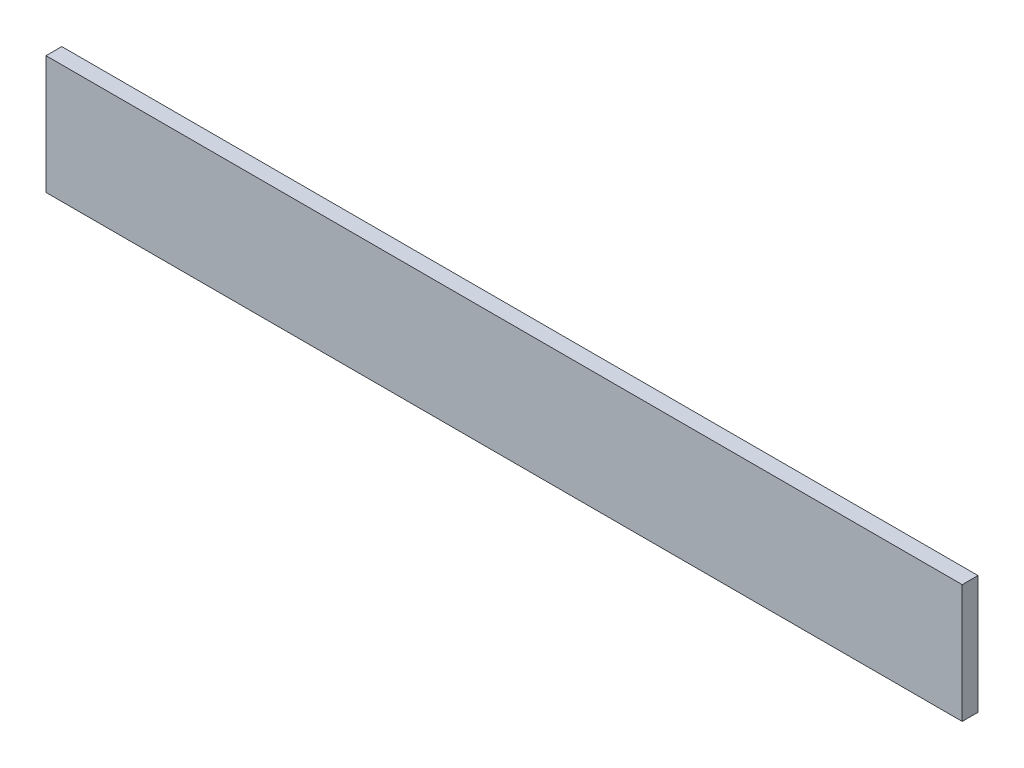
ISO-10303-21;
HEADER;
FILE_DESCRIPTION(('STEP AP214'),'2;1');
FILE_NAME('part.step','',(''),(''),'','','');
FILE_SCHEMA(('AUTOMOTIVE_DESIGN { 1 0 10303 214 1 1 1 1 }'));
ENDSEC;
DATA;
#1=APPLICATION_CONTEXT('core data for automotive mechanical design processes');
#2=APPLICATION_PROTOCOL_DEFINITION('international standard','automotive_design',2000,#1);
#3=PRODUCT_CONTEXT('',#1,'mechanical');
#4=PRODUCT('Part','Part','',(#3));
#5=PRODUCT_RELATED_PRODUCT_CATEGORY('part','',(#4));
#6=PRODUCT_DEFINITION_FORMATION('','',#4);
#7=PRODUCT_DEFINITION_CONTEXT('part definition',#1,'design');
#8=PRODUCT_DEFINITION('design','',#6,#7);
#9=PRODUCT_DEFINITION_SHAPE('','',#8);
#10=(LENGTH_UNIT() NAMED_UNIT(*) SI_UNIT(.MILLI.,.METRE.));
#11=(NAMED_UNIT(*) PLANE_ANGLE_UNIT() SI_UNIT($,.RADIAN.));
#12=(NAMED_UNIT(*) SI_UNIT($,.STERADIAN.) SOLID_ANGLE_UNIT());
#13=UNCERTAINTY_MEASURE_WITH_UNIT(LENGTH_MEASURE(1.E-05),#10,'distance_accuracy_value','');
#14=(GEOMETRIC_REPRESENTATION_CONTEXT(3) GLOBAL_UNCERTAINTY_ASSIGNED_CONTEXT((#13)) GLOBAL_UNIT_ASSIGNED_CONTEXT((#10,
#11,#12)) REPRESENTATION_CONTEXT('',''));
#15=CARTESIAN_POINT('',(0.,0.,0.));
#16=DIRECTION('',(0.,0.,1.));
#17=DIRECTION('',(1.,0.,0.));
#18=AXIS2_PLACEMENT_3D('',#15,#16,#17);
#19=CARTESIAN_POINT('',(-1.44999964,-0.18750026,0.0499999));
#20=DIRECTION('',(0.,0.,1.));
#21=DIRECTION('',(1.,0.,0.));
#22=AXIS2_PLACEMENT_3D('',#19,#20,#21);
#23=PLANE('',#22);
#24=DIRECTION('',(-1.,0.,0.));
#25=VECTOR('',#24,1.);
#26=CARTESIAN_POINT('',(1.44999964,-0.18750026,0.0499999));
#27=LINE('',#26,#25);
#28=CARTESIAN_POINT('',(1.44999964,-0.18750026,0.0499999));
#29=VERTEX_POINT('',#28);
#30=CARTESIAN_POINT('',(-1.44999964,-0.18750026,0.0499999));
#31=VERTEX_POINT('',#30);
#32=EDGE_CURVE('E20',#29,#31,#27,.T.);
#33=ORIENTED_EDGE('',*,*,#32,.F.);
#34=DIRECTION('',(0.,-1.,0.));
#35=VECTOR('',#34,1.);
#36=CARTESIAN_POINT('',(1.44999964,0.18750026,0.0499999));
#37=LINE('',#36,#35);
#38=CARTESIAN_POINT('',(1.44999964,0.18750026,0.0499999));
#39=VERTEX_POINT('',#38);
#40=EDGE_CURVE('E109',#39,#29,#37,.T.);
#41=ORIENTED_EDGE('',*,*,#40,.F.);
#42=DIRECTION('',(1.,0.,0.));
#43=VECTOR('',#42,1.);
#44=CARTESIAN_POINT('',(-1.44999964,0.18750026,0.0499999));
#45=LINE('',#44,#43);
#46=CARTESIAN_POINT('',(-1.44999964,0.18750026,0.0499999));
#47=VERTEX_POINT('',#46);
#48=EDGE_CURVE('E84',#47,#39,#45,.T.);
#49=ORIENTED_EDGE('',*,*,#48,.F.);
#50=DIRECTION('',(0.,1.,0.));
#51=VECTOR('',#50,1.);
#52=CARTESIAN_POINT('',(-1.44999964,-0.18750026,0.0499999));
#53=LINE('',#52,#51);
#54=EDGE_CURVE('E88',#31,#47,#53,.T.);
#55=ORIENTED_EDGE('',*,*,#54,.F.);
#56=EDGE_LOOP('',(#33,#41,#49,#55));
#57=FACE_BOUND('',#56,.T.);
#58=ADVANCED_FACE('F17',(#57),#23,.T.);
#59=CARTESIAN_POINT('',(-1.44999964,-0.18750026,0.));
#60=DIRECTION('',(0.,0.,1.));
#61=DIRECTION('',(1.,0.,0.));
#62=AXIS2_PLACEMENT_3D('',#59,#60,#61);
#63=PLANE('',#62);
#64=DIRECTION('',(0.,1.,0.));
#65=VECTOR('',#64,1.);
#66=CARTESIAN_POINT('',(-1.44999964,-0.18750026,0.));
#67=LINE('',#66,#65);
#68=CARTESIAN_POINT('',(-1.44999964,-0.18750026,0.));
#69=VERTEX_POINT('',#68);
#70=CARTESIAN_POINT('',(-1.44999964,0.18750026,0.));
#71=VERTEX_POINT('',#70);
#72=EDGE_CURVE('E72',#69,#71,#67,.T.);
#73=ORIENTED_EDGE('',*,*,#72,.T.);
#74=DIRECTION('',(1.,0.,0.));
#75=VECTOR('',#74,1.);
#76=CARTESIAN_POINT('',(-1.44999964,0.18750026,0.));
#77=LINE('',#76,#75);
#78=CARTESIAN_POINT('',(1.44999964,0.18750026,0.));
#79=VERTEX_POINT('',#78);
#80=EDGE_CURVE('E102',#71,#79,#77,.T.);
#81=ORIENTED_EDGE('',*,*,#80,.T.);
#82=DIRECTION('',(0.,-1.,0.));
#83=VECTOR('',#82,1.);
#84=CARTESIAN_POINT('',(1.44999964,0.18750026,0.));
#85=LINE('',#84,#83);
#86=CARTESIAN_POINT('',(1.44999964,-0.18750026,0.));
#87=VERTEX_POINT('',#86);
#88=EDGE_CURVE('E74',#79,#87,#85,.T.);
#89=ORIENTED_EDGE('',*,*,#88,.T.);
#90=DIRECTION('',(-1.,0.,0.));
#91=VECTOR('',#90,1.);
#92=CARTESIAN_POINT('',(1.44999964,-0.18750026,0.));
#93=LINE('',#92,#91);
#94=EDGE_CURVE('E11',#87,#69,#93,.T.);
#95=ORIENTED_EDGE('',*,*,#94,.T.);
#96=EDGE_LOOP('',(#73,#81,#89,#95));
#97=FACE_BOUND('',#96,.T.);
#98=ADVANCED_FACE('F70',(#97),#63,.F.);
#99=CARTESIAN_POINT('',(1.44999964,-0.18750026,0.));
#100=DIRECTION('',(0.,-1.,0.));
#101=DIRECTION('',(0.,0.,-1.));
#102=AXIS2_PLACEMENT_3D('',#99,#100,#101);
#103=PLANE('',#102);
#104=DIRECTION('',(0.,0.,1.));
#105=VECTOR('',#104,1.);
#106=CARTESIAN_POINT('',(1.44999964,-0.18750026,0.));
#107=LINE('',#106,#105);
#108=EDGE_CURVE('E112',#87,#29,#107,.T.);
#109=ORIENTED_EDGE('',*,*,#108,.T.);
#110=ORIENTED_EDGE('',*,*,#32,.T.);
#111=DIRECTION('',(0.,0.,1.));
#112=VECTOR('',#111,1.);
#113=CARTESIAN_POINT('',(-1.44999964,-0.18750026,0.));
#114=LINE('',#113,#112);
#115=EDGE_CURVE('E80',#69,#31,#114,.T.);
#116=ORIENTED_EDGE('',*,*,#115,.F.);
#117=ORIENTED_EDGE('',*,*,#94,.F.);
#118=EDGE_LOOP('',(#109,#110,#116,#117));
#119=FACE_BOUND('',#118,.T.);
#120=ADVANCED_FACE('F86',(#119),#103,.T.);
#121=CARTESIAN_POINT('',(1.44999964,0.18750026,0.));
#122=DIRECTION('',(1.,0.,0.));
#123=DIRECTION('',(0.,1.,0.));
#124=AXIS2_PLACEMENT_3D('',#121,#122,#123);
#125=PLANE('',#124);
#126=DIRECTION('',(0.,0.,1.));
#127=VECTOR('',#126,1.);
#128=CARTESIAN_POINT('',(1.44999964,0.18750026,0.));
#129=LINE('',#128,#127);
#130=EDGE_CURVE('E99',#79,#39,#129,.T.);
#131=ORIENTED_EDGE('',*,*,#130,.T.);
#132=ORIENTED_EDGE('',*,*,#40,.T.);
#133=ORIENTED_EDGE('',*,*,#108,.F.);
#134=ORIENTED_EDGE('',*,*,#88,.F.);
#135=EDGE_LOOP('',(#131,#132,#133,#134));
#136=FACE_BOUND('',#135,.T.);
#137=ADVANCED_FACE('F146',(#136),#125,.T.);
#138=CARTESIAN_POINT('',(-1.44999964,0.18750026,0.));
#139=DIRECTION('',(0.,1.,0.));
#140=DIRECTION('',(1.,0.,0.));
#141=AXIS2_PLACEMENT_3D('',#138,#139,#140);
#142=PLANE('',#141);
#143=DIRECTION('',(0.,0.,1.));
#144=VECTOR('',#143,1.);
#145=CARTESIAN_POINT('',(-1.44999964,0.18750026,0.));
#146=LINE('',#145,#144);
#147=EDGE_CURVE('E82',#71,#47,#146,.T.);
#148=ORIENTED_EDGE('',*,*,#147,.T.);
#149=ORIENTED_EDGE('',*,*,#48,.T.);
#150=ORIENTED_EDGE('',*,*,#130,.F.);
#151=ORIENTED_EDGE('',*,*,#80,.F.);
#152=EDGE_LOOP('',(#148,#149,#150,#151));
#153=FACE_BOUND('',#152,.T.);
#154=ADVANCED_FACE('F134',(#153),#142,.T.);
#155=CARTESIAN_POINT('',(-1.44999964,-0.18750026,0.));
#156=DIRECTION('',(-1.,0.,0.));
#157=DIRECTION('',(0.,0.,1.));
#158=AXIS2_PLACEMENT_3D('',#155,#156,#157);
#159=PLANE('',#158);
#160=ORIENTED_EDGE('',*,*,#115,.T.);
#161=ORIENTED_EDGE('',*,*,#54,.T.);
#162=ORIENTED_EDGE('',*,*,#147,.F.);
#163=ORIENTED_EDGE('',*,*,#72,.F.);
#164=EDGE_LOOP('',(#160,#161,#162,#163));
#165=FACE_BOUND('',#164,.T.);
#166=ADVANCED_FACE('F78',(#165),#159,.T.);
#167=CLOSED_SHELL('',(#58,#98,#120,#137,#154,#166));
#168=MANIFOLD_SOLID_BREP('B1',#167);
#169=ADVANCED_BREP_SHAPE_REPRESENTATION('',(#18,#168),#14);
#170=SHAPE_DEFINITION_REPRESENTATION(#9,#169);
ENDSEC;
END-ISO-10303-21;
